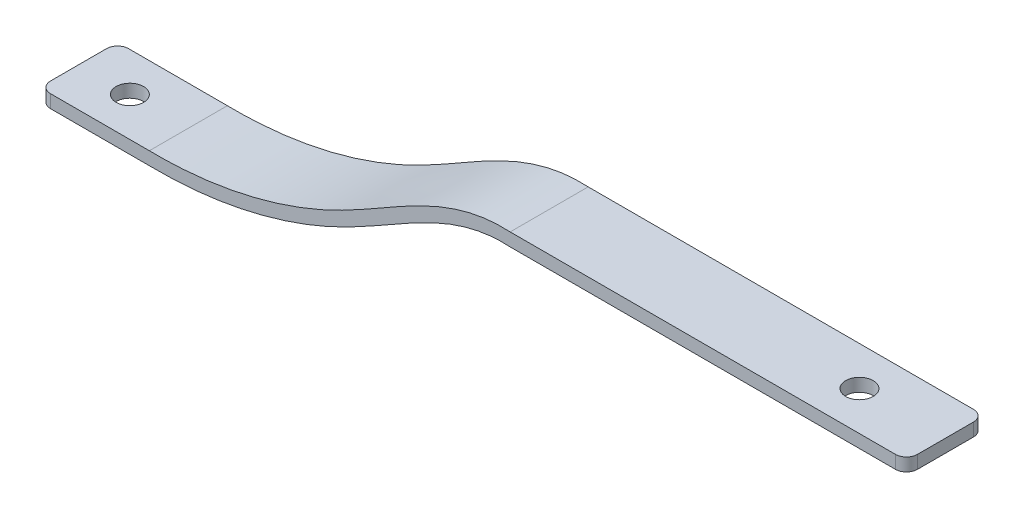
ISO-10303-21;
HEADER;
FILE_DESCRIPTION(('STEP AP214'),'2;1');
FILE_NAME('part.step','',(''),(''),'','','');
FILE_SCHEMA(('AUTOMOTIVE_DESIGN { 1 0 10303 214 1 1 1 1 }'));
ENDSEC;
DATA;
#1=APPLICATION_CONTEXT('core data for automotive mechanical design processes');
#2=APPLICATION_PROTOCOL_DEFINITION('international standard','automotive_design',2000,#1);
#3=PRODUCT_CONTEXT('',#1,'mechanical');
#4=PRODUCT('Part','Part','',(#3));
#5=PRODUCT_RELATED_PRODUCT_CATEGORY('part','',(#4));
#6=PRODUCT_DEFINITION_FORMATION('','',#4);
#7=PRODUCT_DEFINITION_CONTEXT('part definition',#1,'design');
#8=PRODUCT_DEFINITION('design','',#6,#7);
#9=PRODUCT_DEFINITION_SHAPE('','',#8);
#10=(LENGTH_UNIT() NAMED_UNIT(*) SI_UNIT(.MILLI.,.METRE.));
#11=(NAMED_UNIT(*) PLANE_ANGLE_UNIT() SI_UNIT($,.RADIAN.));
#12=(NAMED_UNIT(*) SI_UNIT($,.STERADIAN.) SOLID_ANGLE_UNIT());
#13=UNCERTAINTY_MEASURE_WITH_UNIT(LENGTH_MEASURE(1.E-05),#10,'distance_accuracy_value','');
#14=(GEOMETRIC_REPRESENTATION_CONTEXT(3) GLOBAL_UNCERTAINTY_ASSIGNED_CONTEXT((#13)) GLOBAL_UNIT_ASSIGNED_CONTEXT((#10,
#11,#12)) REPRESENTATION_CONTEXT('',''));
#15=CARTESIAN_POINT('',(0.,0.,0.));
#16=DIRECTION('',(0.,0.,1.));
#17=DIRECTION('',(1.,0.,0.));
#18=AXIS2_PLACEMENT_3D('',#15,#16,#17);
#19=CARTESIAN_POINT('',(0.,-23.9,18.));
#20=DIRECTION('',(1.,0.,0.));
#21=DIRECTION('',(0.,0.,-1.));
#22=AXIS2_PLACEMENT_3D('',#19,#20,#21);
#23=PLANE('',#22);
#24=DIRECTION('',(0.,0.,-1.));
#25=VECTOR('',#24,1.);
#26=CARTESIAN_POINT('',(0.,-26.9,18.));
#27=LINE('',#26,#25);
#28=CARTESIAN_POINT('',(0.,-26.9,15.46));
#29=VERTEX_POINT('',#28);
#30=CARTESIAN_POINT('',(0.,-26.9,2.54));
#31=VERTEX_POINT('',#30);
#32=EDGE_CURVE('E146',#29,#31,#27,.T.);
#33=ORIENTED_EDGE('',*,*,#32,.F.);
#34=DIRECTION('',(0.,-1.,0.));
#35=VECTOR('',#34,1.);
#36=CARTESIAN_POINT('',(0.,-23.9,15.46));
#37=LINE('',#36,#35);
#38=CARTESIAN_POINT('',(0.,-23.9,15.46));
#39=VERTEX_POINT('',#38);
#40=EDGE_CURVE('E225',#29,#39,#37,.F.);
#41=ORIENTED_EDGE('',*,*,#40,.T.);
#42=DIRECTION('',(0.,0.,-1.));
#43=VECTOR('',#42,1.);
#44=CARTESIAN_POINT('',(0.,-23.9,18.));
#45=LINE('',#44,#43);
#46=CARTESIAN_POINT('',(0.,-23.9,2.54));
#47=VERTEX_POINT('',#46);
#48=EDGE_CURVE('E251',#39,#47,#45,.T.);
#49=ORIENTED_EDGE('',*,*,#48,.T.);
#50=DIRECTION('',(0.,-1.,0.));
#51=VECTOR('',#50,1.);
#52=CARTESIAN_POINT('',(0.,-26.9,2.54));
#53=LINE('',#52,#51);
#54=EDGE_CURVE('E222',#47,#31,#53,.T.);
#55=ORIENTED_EDGE('',*,*,#54,.T.);
#56=EDGE_LOOP('',(#33,#41,#49,#55));
#57=FACE_BOUND('',#56,.T.);
#58=ADVANCED_FACE('F37',(#57),#23,.F.);
#59=CARTESIAN_POINT('',(0.,-26.9,18.));
#60=DIRECTION('',(0.,1.,0.));
#61=DIRECTION('',(-1.,0.,0.));
#62=AXIS2_PLACEMENT_3D('',#59,#60,#61);
#63=PLANE('',#62);
#64=CARTESIAN_POINT('',(11.8473744615528,-26.9,9.));
#65=DIRECTION('',(0.,1.,0.));
#66=DIRECTION('',(-1.,0.,0.));
#67=AXIS2_PLACEMENT_3D('',#64,#65,#66);
#68=CIRCLE('',#67,3.175);
#69=CARTESIAN_POINT('',(8.67237446155276,-26.9,9.));
#70=VERTEX_POINT('',#69);
#71=EDGE_CURVE('E310',#70,#70,#68,.T.);
#72=ORIENTED_EDGE('',*,*,#71,.T.);
#73=EDGE_LOOP('',(#72));
#74=FACE_BOUND('',#73,.T.);
#75=DIRECTION('',(1.,0.,0.));
#76=VECTOR('',#75,1.);
#77=CARTESIAN_POINT('',(0.,-26.9,18.));
#78=LINE('',#77,#76);
#79=CARTESIAN_POINT('',(2.54,-26.9,18.));
#80=VERTEX_POINT('',#79);
#81=CARTESIAN_POINT('',(25.3146595438533,-26.9,18.));
#82=VERTEX_POINT('',#81);
#83=EDGE_CURVE('E126',#80,#82,#78,.T.);
#84=ORIENTED_EDGE('',*,*,#83,.F.);
#85=CARTESIAN_POINT('',(2.54,-26.9,15.46));
#86=DIRECTION('',(0.,1.,0.));
#87=DIRECTION('',(-1.,0.,0.));
#88=AXIS2_PLACEMENT_3D('',#85,#86,#87);
#89=CIRCLE('',#88,2.54);
#90=EDGE_CURVE('E220',#80,#29,#89,.F.);
#91=ORIENTED_EDGE('',*,*,#90,.T.);
#92=ORIENTED_EDGE('',*,*,#32,.T.);
#93=CARTESIAN_POINT('',(2.54,-26.9,2.54));
#94=DIRECTION('',(0.,1.,0.));
#95=DIRECTION('',(-1.,0.,0.));
#96=AXIS2_PLACEMENT_3D('',#93,#94,#95);
#97=CIRCLE('',#96,2.54);
#98=CARTESIAN_POINT('',(2.54,-26.9,0.));
#99=VERTEX_POINT('',#98);
#100=EDGE_CURVE('E212',#31,#99,#97,.F.);
#101=ORIENTED_EDGE('',*,*,#100,.T.);
#102=DIRECTION('',(1.,0.,0.));
#103=VECTOR('',#102,1.);
#104=CARTESIAN_POINT('',(0.,-26.9,0.));
#105=LINE('',#104,#103);
#106=CARTESIAN_POINT('',(25.3146595438533,-26.9,0.));
#107=VERTEX_POINT('',#106);
#108=EDGE_CURVE('E143',#99,#107,#105,.T.);
#109=ORIENTED_EDGE('',*,*,#108,.T.);
#110=DIRECTION('',(0.,0.,-1.));
#111=VECTOR('',#110,1.);
#112=CARTESIAN_POINT('',(25.3146595438533,-26.9,18.));
#113=LINE('',#112,#111);
#114=EDGE_CURVE('E140',#82,#107,#113,.T.);
#115=ORIENTED_EDGE('',*,*,#114,.F.);
#116=EDGE_LOOP('',(#84,#91,#92,#101,#109,#115));
#117=FACE_BOUND('',#116,.T.);
#118=ADVANCED_FACE('F141',(#74,#117),#63,.F.);
#119=CARTESIAN_POINT('',(25.3146595438533,-26.9,18.));
#120=CARTESIAN_POINT('',(29.0188089023951,-26.9594659895073,18.));
#121=CARTESIAN_POINT('',(36.4383206519169,-26.6538189362123,18.));
#122=CARTESIAN_POINT('',(47.4522737321045,-24.9248831297301,18.));
#123=CARTESIAN_POINT('',(58.2624866138257,-21.9243187824402,18.));
#124=CARTESIAN_POINT('',(67.0160136019704,-18.3796569401195,18.));
#125=CARTESIAN_POINT('',(73.8117428512232,-14.8903088175918,18.));
#126=CARTESIAN_POINT('',(80.4274132065217,-11.1303025465361,18.));
#127=CARTESIAN_POINT('',(86.8972359139718,-7.36910982344604,18.));
#128=CARTESIAN_POINT('',(93.386399422182,-4.32704164879955,18.));
#129=CARTESIAN_POINT('',(98.2984726060715,-2.5786662778352,18.));
#130=CARTESIAN_POINT('',(102.470883409743,-1.70349458257518,18.));
#131=CARTESIAN_POINT('',(105.870866673329,-1.42833186149195,18.));
#132=CARTESIAN_POINT('',(107.62357722685,-1.44998458261965,18.));
#133=CARTESIAN_POINT('',(108.491279544418,-1.5,18.));
#134=B_SPLINE_CURVE_WITH_KNOTS('',3,(#119,#120,#121,#122,#123,#124,#125,#126,#127,#128,#129,
#130,#131,#132,#133),.UNSPECIFIED.,.F.,.F.,(4,1,1,1,1,1,1,1,1,1,1,1,4),(0.000136912202319817,
0.125180550793314,0.250224189384307,0.375267827975301,0.500311466566295,0.562833285861792,
0.625355105157289,0.750398743748282,0.812920563043779,0.875442382339276,0.937964201634773,
0.969225111282522,1.00048602093027),.UNSPECIFIED.);
#135=DIRECTION('',(0.,0.,-1.));
#136=VECTOR('',#135,1.);
#137=SURFACE_OF_LINEAR_EXTRUSION('',#134,#136);
#138=CARTESIAN_POINT('',(25.3146595438533,-26.9,0.));
#139=CARTESIAN_POINT('',(29.0188089023951,-26.9594659895073,0.));
#140=CARTESIAN_POINT('',(36.4383206519169,-26.6538189362123,0.));
#141=CARTESIAN_POINT('',(47.4522737321045,-24.9248831297301,0.));
#142=CARTESIAN_POINT('',(58.2624866138257,-21.9243187824402,0.));
#143=CARTESIAN_POINT('',(67.0160136019704,-18.3796569401195,0.));
#144=CARTESIAN_POINT('',(73.8117428512232,-14.8903088175918,0.));
#145=CARTESIAN_POINT('',(80.4274132065217,-11.1303025465361,0.));
#146=CARTESIAN_POINT('',(86.8972359139718,-7.36910982344604,0.));
#147=CARTESIAN_POINT('',(93.386399422182,-4.32704164879955,0.));
#148=CARTESIAN_POINT('',(98.2984726060715,-2.5786662778352,0.));
#149=CARTESIAN_POINT('',(102.470883409743,-1.70349458257518,0.));
#150=CARTESIAN_POINT('',(105.870866673329,-1.42833186149195,0.));
#151=CARTESIAN_POINT('',(107.62357722685,-1.44998458261965,0.));
#152=CARTESIAN_POINT('',(108.491279544418,-1.5,0.));
#153=B_SPLINE_CURVE_WITH_KNOTS('',3,(#138,#139,#140,#141,#142,#143,#144,#145,#146,#147,#148,
#149,#150,#151,#152),.UNSPECIFIED.,.F.,.F.,(4,1,1,1,1,1,1,1,1,1,1,1,4),(0.000136912202319817,
0.125180550793314,0.250224189384307,0.375267827975301,0.500311466566295,0.562833285861792,
0.625355105157289,0.750398743748282,0.812920563043779,0.875442382339276,0.937964201634773,
0.969225111282522,1.00048602093027),.UNSPECIFIED.);
#154=CARTESIAN_POINT('',(108.491279544418,-1.5,0.));
#155=VERTEX_POINT('',#154);
#156=EDGE_CURVE('E268',#107,#155,#153,.T.);
#157=ORIENTED_EDGE('',*,*,#156,.T.);
#158=DIRECTION('',(0.,0.,-1.));
#159=VECTOR('',#158,1.);
#160=CARTESIAN_POINT('',(108.491279544418,-1.5,18.));
#161=LINE('',#160,#159);
#162=CARTESIAN_POINT('',(108.491279544418,-1.5,18.));
#163=VERTEX_POINT('',#162);
#164=EDGE_CURVE('E147',#163,#155,#161,.T.);
#165=ORIENTED_EDGE('',*,*,#164,.F.);
#166=EDGE_CURVE('E132',#82,#163,#134,.T.);
#167=ORIENTED_EDGE('',*,*,#166,.F.);
#168=ORIENTED_EDGE('',*,*,#114,.T.);
#169=EDGE_LOOP('',(#157,#165,#167,#168));
#170=FACE_BOUND('',#169,.T.);
#171=ADVANCED_FACE('F149',(#170),#137,.F.);
#172=CARTESIAN_POINT('',(108.491279544418,-1.5,18.));
#173=DIRECTION('',(0.,1.,0.));
#174=DIRECTION('',(-1.,0.,0.));
#175=AXIS2_PLACEMENT_3D('',#172,#173,#174);
#176=PLANE('',#175);
#177=CARTESIAN_POINT('',(180.157387408216,-1.5,9.));
#178=DIRECTION('',(0.,1.,0.));
#179=DIRECTION('',(-1.,0.,0.));
#180=AXIS2_PLACEMENT_3D('',#177,#178,#179);
#181=CIRCLE('',#180,3.175);
#182=CARTESIAN_POINT('',(176.982387408216,-1.5,9.));
#183=VERTEX_POINT('',#182);
#184=EDGE_CURVE('E308',#183,#183,#181,.T.);
#185=ORIENTED_EDGE('',*,*,#184,.T.);
#186=EDGE_LOOP('',(#185));
#187=FACE_BOUND('',#186,.T.);
#188=DIRECTION('',(1.,0.,0.));
#189=VECTOR('',#188,1.);
#190=CARTESIAN_POINT('',(108.491279544418,-1.5,0.));
#191=LINE('',#190,#189);
#192=CARTESIAN_POINT('',(197.46,-1.5,0.));
#193=VERTEX_POINT('',#192);
#194=EDGE_CURVE('E267',#155,#193,#191,.T.);
#195=ORIENTED_EDGE('',*,*,#194,.T.);
#196=CARTESIAN_POINT('',(197.46,-1.5,2.54));
#197=DIRECTION('',(0.,1.,0.));
#198=DIRECTION('',(-1.,0.,0.));
#199=AXIS2_PLACEMENT_3D('',#196,#197,#198);
#200=CIRCLE('',#199,2.54);
#201=CARTESIAN_POINT('',(200.,-1.5,2.54));
#202=VERTEX_POINT('',#201);
#203=EDGE_CURVE('E11',#193,#202,#200,.F.);
#204=ORIENTED_EDGE('',*,*,#203,.T.);
#205=DIRECTION('',(0.,0.,-1.));
#206=VECTOR('',#205,1.);
#207=CARTESIAN_POINT('',(200.,-1.5,18.));
#208=LINE('',#207,#206);
#209=CARTESIAN_POINT('',(200.,-1.5,15.46));
#210=VERTEX_POINT('',#209);
#211=EDGE_CURVE('E206',#210,#202,#208,.T.);
#212=ORIENTED_EDGE('',*,*,#211,.F.);
#213=CARTESIAN_POINT('',(197.46,-1.5,15.46));
#214=DIRECTION('',(0.,1.,0.));
#215=DIRECTION('',(-1.,0.,0.));
#216=AXIS2_PLACEMENT_3D('',#213,#214,#215);
#217=CIRCLE('',#216,2.54);
#218=CARTESIAN_POINT('',(197.46,-1.5,18.));
#219=VERTEX_POINT('',#218);
#220=EDGE_CURVE('E45',#210,#219,#217,.F.);
#221=ORIENTED_EDGE('',*,*,#220,.T.);
#222=DIRECTION('',(1.,0.,0.));
#223=VECTOR('',#222,1.);
#224=CARTESIAN_POINT('',(108.491279544418,-1.5,18.));
#225=LINE('',#224,#223);
#226=EDGE_CURVE('E152',#163,#219,#225,.T.);
#227=ORIENTED_EDGE('',*,*,#226,.F.);
#228=ORIENTED_EDGE('',*,*,#164,.T.);
#229=EDGE_LOOP('',(#195,#204,#212,#221,#227,#228));
#230=FACE_BOUND('',#229,.T.);
#231=ADVANCED_FACE('F168',(#187,#230),#176,.F.);
#232=CARTESIAN_POINT('',(200.,1.5,18.));
#233=DIRECTION('',(-1.,0.,0.));
#234=DIRECTION('',(0.,0.,1.));
#235=AXIS2_PLACEMENT_3D('',#232,#233,#234);
#236=PLANE('',#235);
#237=ORIENTED_EDGE('',*,*,#211,.T.);
#238=DIRECTION('',(0.,1.,0.));
#239=VECTOR('',#238,1.);
#240=CARTESIAN_POINT('',(200.,1.5,2.54));
#241=LINE('',#240,#239);
#242=CARTESIAN_POINT('',(200.,1.5,2.54));
#243=VERTEX_POINT('',#242);
#244=EDGE_CURVE('E195',#202,#243,#241,.T.);
#245=ORIENTED_EDGE('',*,*,#244,.T.);
#246=DIRECTION('',(0.,0.,-1.));
#247=VECTOR('',#246,1.);
#248=CARTESIAN_POINT('',(200.,1.5,18.));
#249=LINE('',#248,#247);
#250=CARTESIAN_POINT('',(200.,1.5,15.46));
#251=VERTEX_POINT('',#250);
#252=EDGE_CURVE('E263',#251,#243,#249,.T.);
#253=ORIENTED_EDGE('',*,*,#252,.F.);
#254=DIRECTION('',(0.,1.,0.));
#255=VECTOR('',#254,1.);
#256=CARTESIAN_POINT('',(200.,1.5,15.46));
#257=LINE('',#256,#255);
#258=EDGE_CURVE('E57',#251,#210,#257,.F.);
#259=ORIENTED_EDGE('',*,*,#258,.T.);
#260=EDGE_LOOP('',(#237,#245,#253,#259));
#261=FACE_BOUND('',#260,.T.);
#262=ADVANCED_FACE('F288',(#261),#236,.F.);
#263=CARTESIAN_POINT('',(108.577128093898,1.49999999999999,18.));
#264=DIRECTION('',(0.,-1.,0.));
#265=DIRECTION('',(1.,0.,0.));
#266=AXIS2_PLACEMENT_3D('',#263,#264,#265);
#267=PLANE('',#266);
#268=CARTESIAN_POINT('',(180.157387408216,1.49999999999999,9.));
#269=DIRECTION('',(0.,1.,0.));
#270=DIRECTION('',(-1.,0.,0.));
#271=AXIS2_PLACEMENT_3D('',#268,#269,#270);
#272=CIRCLE('',#271,3.175);
#273=CARTESIAN_POINT('',(176.982387408216,1.49999999999999,9.));
#274=VERTEX_POINT('',#273);
#275=EDGE_CURVE('E315',#274,#274,#272,.T.);
#276=ORIENTED_EDGE('',*,*,#275,.F.);
#277=EDGE_LOOP('',(#276));
#278=FACE_BOUND('',#277,.T.);
#279=ORIENTED_EDGE('',*,*,#252,.T.);
#280=CARTESIAN_POINT('',(197.46,1.5,2.54));
#281=DIRECTION('',(0.,-1.,0.));
#282=DIRECTION('',(1.,0.,0.));
#283=AXIS2_PLACEMENT_3D('',#280,#281,#282);
#284=CIRCLE('',#283,2.54);
#285=CARTESIAN_POINT('',(197.46,1.5,0.));
#286=VERTEX_POINT('',#285);
#287=EDGE_CURVE('E196',#243,#286,#284,.F.);
#288=ORIENTED_EDGE('',*,*,#287,.T.);
#289=DIRECTION('',(-1.,0.,0.));
#290=VECTOR('',#289,1.);
#291=CARTESIAN_POINT('',(108.577128093898,1.49999999999999,0.));
#292=LINE('',#291,#290);
#293=CARTESIAN_POINT('',(108.577128093898,1.49999999999999,0.));
#294=VERTEX_POINT('',#293);
#295=EDGE_CURVE('E270',#286,#294,#292,.T.);
#296=ORIENTED_EDGE('',*,*,#295,.T.);
#297=DIRECTION('',(0.,0.,-1.));
#298=VECTOR('',#297,1.);
#299=CARTESIAN_POINT('',(108.577128093898,1.49999999999999,18.));
#300=LINE('',#299,#298);
#301=CARTESIAN_POINT('',(108.577128093898,1.49999999999999,18.));
#302=VERTEX_POINT('',#301);
#303=EDGE_CURVE('E255',#302,#294,#300,.T.);
#304=ORIENTED_EDGE('',*,*,#303,.F.);
#305=DIRECTION('',(-1.,0.,0.));
#306=VECTOR('',#305,1.);
#307=CARTESIAN_POINT('',(108.577128093898,1.49999999999999,18.));
#308=LINE('',#307,#306);
#309=CARTESIAN_POINT('',(197.46,1.5,18.));
#310=VERTEX_POINT('',#309);
#311=EDGE_CURVE('E154',#310,#302,#308,.T.);
#312=ORIENTED_EDGE('',*,*,#311,.F.);
#313=CARTESIAN_POINT('',(197.46,1.5,15.46));
#314=DIRECTION('',(0.,-1.,0.));
#315=DIRECTION('',(1.,0.,0.));
#316=AXIS2_PLACEMENT_3D('',#313,#314,#315);
#317=CIRCLE('',#316,2.54);
#318=EDGE_CURVE('E198',#310,#251,#317,.F.);
#319=ORIENTED_EDGE('',*,*,#318,.T.);
#320=EDGE_LOOP('',(#279,#288,#296,#304,#312,#319));
#321=FACE_BOUND('',#320,.T.);
#322=ADVANCED_FACE('F287',(#278,#321),#267,.F.);
#323=CARTESIAN_POINT('',(108.577128093898,1.49999999999999,18.));
#324=CARTESIAN_POINT('',(107.618230329989,1.55390102329499,18.));
#325=CARTESIAN_POINT('',(105.679869219331,1.57019239529077,18.));
#326=CARTESIAN_POINT('',(101.932358433972,1.25768993450628,18.));
#327=CARTESIAN_POINT('',(97.3881306078473,0.29011244531542,18.));
#328=CARTESIAN_POINT('',(92.1558948845653,-1.5851373976083,18.));
#329=CARTESIAN_POINT('',(85.3949770849972,-4.7667373788956,18.));
#330=CARTESIAN_POINT('',(78.8488467239236,-8.57909358736543,18.));
#331=CARTESIAN_POINT('',(72.3147602776489,-12.2884855401058,18.));
#332=CARTESIAN_POINT('',(65.7324938138277,-15.6624775430745,18.));
#333=CARTESIAN_POINT('',(57.2484472089135,-19.0934108720935,18.));
#334=CARTESIAN_POINT('',(46.7783237633653,-21.9940665798706,18.));
#335=CARTESIAN_POINT('',(36.111765906608,-23.66482794599,18.));
#336=CARTESIAN_POINT('',(28.9261620883657,-23.9580396061826,18.));
#337=CARTESIAN_POINT('',(25.3388796665266,-23.9,18.));
#338=B_SPLINE_CURVE_WITH_KNOTS('',3,(#323,#324,#325,#326,#327,#328,#329,#330,#331,#332,#333,
#334,#335,#336,#337),.UNSPECIFIED.,.F.,.F.,(4,1,1,1,1,1,1,1,1,1,1,1,4),(-0.000138519880971891,
0.03110117925142,0.0623408783838119,0.124820276648596,0.187299674913379,0.249779073178163,
0.37473786970773,0.437217267972514,0.499696666237298,0.624655462766865,0.749614259296433,
0.874573055826,0.999531852355567),.UNSPECIFIED.);
#339=DIRECTION('',(0.,0.,-1.));
#340=VECTOR('',#339,1.);
#341=SURFACE_OF_LINEAR_EXTRUSION('',#338,#340);
#342=CARTESIAN_POINT('',(108.577128093898,1.49999999999999,0.));
#343=CARTESIAN_POINT('',(107.618230329989,1.55390102329499,0.));
#344=CARTESIAN_POINT('',(105.679869219331,1.57019239529077,0.));
#345=CARTESIAN_POINT('',(101.932358433972,1.25768993450628,0.));
#346=CARTESIAN_POINT('',(97.3881306078473,0.29011244531542,0.));
#347=CARTESIAN_POINT('',(92.1558948845653,-1.5851373976083,0.));
#348=CARTESIAN_POINT('',(85.3949770849972,-4.7667373788956,0.));
#349=CARTESIAN_POINT('',(78.8488467239236,-8.57909358736543,0.));
#350=CARTESIAN_POINT('',(72.3147602776489,-12.2884855401058,0.));
#351=CARTESIAN_POINT('',(65.7324938138277,-15.6624775430745,0.));
#352=CARTESIAN_POINT('',(57.2484472089135,-19.0934108720935,0.));
#353=CARTESIAN_POINT('',(46.7783237633653,-21.9940665798706,0.));
#354=CARTESIAN_POINT('',(36.111765906608,-23.66482794599,0.));
#355=CARTESIAN_POINT('',(28.9261620883657,-23.9580396061826,0.));
#356=CARTESIAN_POINT('',(25.3388796665266,-23.9,0.));
#357=B_SPLINE_CURVE_WITH_KNOTS('',3,(#342,#343,#344,#345,#346,#347,#348,#349,#350,#351,#352,
#353,#354,#355,#356),.UNSPECIFIED.,.F.,.F.,(4,1,1,1,1,1,1,1,1,1,1,1,4),(-0.000138519880971891,
0.03110117925142,0.0623408783838119,0.124820276648596,0.187299674913379,0.249779073178163,
0.37473786970773,0.437217267972514,0.499696666237298,0.624655462766865,0.749614259296433,
0.874573055826,0.999531852355567),.UNSPECIFIED.);
#358=CARTESIAN_POINT('',(25.3388796665266,-23.9,0.));
#359=VERTEX_POINT('',#358);
#360=EDGE_CURVE('E246',#294,#359,#357,.T.);
#361=ORIENTED_EDGE('',*,*,#360,.T.);
#362=DIRECTION('',(0.,0.,-1.));
#363=VECTOR('',#362,1.);
#364=CARTESIAN_POINT('',(25.3388796665266,-23.9,18.));
#365=LINE('',#364,#363);
#366=CARTESIAN_POINT('',(25.3388796665266,-23.9,18.));
#367=VERTEX_POINT('',#366);
#368=EDGE_CURVE('E245',#367,#359,#365,.T.);
#369=ORIENTED_EDGE('',*,*,#368,.F.);
#370=EDGE_CURVE('E257',#302,#367,#338,.T.);
#371=ORIENTED_EDGE('',*,*,#370,.F.);
#372=ORIENTED_EDGE('',*,*,#303,.T.);
#373=EDGE_LOOP('',(#361,#369,#371,#372));
#374=FACE_BOUND('',#373,.T.);
#375=ADVANCED_FACE('F283',(#374),#341,.F.);
#376=CARTESIAN_POINT('',(0.,-23.9,18.));
#377=DIRECTION('',(0.,-1.,0.));
#378=DIRECTION('',(1.,0.,0.));
#379=AXIS2_PLACEMENT_3D('',#376,#377,#378);
#380=PLANE('',#379);
#381=CARTESIAN_POINT('',(11.8473744615528,-23.9,9.));
#382=DIRECTION('',(0.,-1.,0.));
#383=DIRECTION('',(1.,0.,0.));
#384=AXIS2_PLACEMENT_3D('',#381,#382,#383);
#385=CIRCLE('',#384,3.175);
#386=CARTESIAN_POINT('',(15.0223744615528,-23.9,9.));
#387=VERTEX_POINT('',#386);
#388=EDGE_CURVE('E217',#387,#387,#385,.T.);
#389=ORIENTED_EDGE('',*,*,#388,.T.);
#390=EDGE_LOOP('',(#389));
#391=FACE_BOUND('',#390,.T.);
#392=ORIENTED_EDGE('',*,*,#48,.F.);
#393=CARTESIAN_POINT('',(2.54,-23.9,15.46));
#394=DIRECTION('',(0.,-1.,0.));
#395=DIRECTION('',(1.,0.,0.));
#396=AXIS2_PLACEMENT_3D('',#393,#394,#395);
#397=CIRCLE('',#396,2.54);
#398=CARTESIAN_POINT('',(2.54,-23.9,18.));
#399=VERTEX_POINT('',#398);
#400=EDGE_CURVE('E229',#39,#399,#397,.F.);
#401=ORIENTED_EDGE('',*,*,#400,.T.);
#402=DIRECTION('',(-1.,0.,0.));
#403=VECTOR('',#402,1.);
#404=CARTESIAN_POINT('',(0.,-23.9,18.));
#405=LINE('',#404,#403);
#406=EDGE_CURVE('E253',#367,#399,#405,.T.);
#407=ORIENTED_EDGE('',*,*,#406,.F.);
#408=ORIENTED_EDGE('',*,*,#368,.T.);
#409=DIRECTION('',(-1.,0.,0.));
#410=VECTOR('',#409,1.);
#411=CARTESIAN_POINT('',(0.,-23.9,0.));
#412=LINE('',#411,#410);
#413=CARTESIAN_POINT('',(2.54,-23.9,0.));
#414=VERTEX_POINT('',#413);
#415=EDGE_CURVE('E137',#359,#414,#412,.T.);
#416=ORIENTED_EDGE('',*,*,#415,.T.);
#417=CARTESIAN_POINT('',(2.54,-23.9,2.54));
#418=DIRECTION('',(0.,-1.,0.));
#419=DIRECTION('',(1.,0.,0.));
#420=AXIS2_PLACEMENT_3D('',#417,#418,#419);
#421=CIRCLE('',#420,2.54);
#422=EDGE_CURVE('E227',#414,#47,#421,.F.);
#423=ORIENTED_EDGE('',*,*,#422,.T.);
#424=EDGE_LOOP('',(#392,#401,#407,#408,#416,#423));
#425=FACE_BOUND('',#424,.T.);
#426=ADVANCED_FACE('F241',(#391,#425),#380,.F.);
#427=CARTESIAN_POINT('',(68.6976882191784,-17.452851688765,18.));
#428=DIRECTION('',(0.,0.,-1.));
#429=DIRECTION('',(-1.,0.,0.));
#430=AXIS2_PLACEMENT_3D('',#427,#428,#429);
#431=PLANE('',#430);
#432=ORIENTED_EDGE('',*,*,#406,.T.);
#433=DIRECTION('',(0.,-1.,0.));
#434=VECTOR('',#433,1.);
#435=CARTESIAN_POINT('',(2.54,-17.452851688765,18.));
#436=LINE('',#435,#434);
#437=EDGE_CURVE('E135',#399,#80,#436,.T.);
#438=ORIENTED_EDGE('',*,*,#437,.T.);
#439=ORIENTED_EDGE('',*,*,#83,.T.);
#440=ORIENTED_EDGE('',*,*,#166,.T.);
#441=ORIENTED_EDGE('',*,*,#226,.T.);
#442=DIRECTION('',(0.,1.,0.));
#443=VECTOR('',#442,1.);
#444=CARTESIAN_POINT('',(197.46,-17.452851688765,18.));
#445=LINE('',#444,#443);
#446=EDGE_CURVE('E209',#219,#310,#445,.T.);
#447=ORIENTED_EDGE('',*,*,#446,.T.);
#448=ORIENTED_EDGE('',*,*,#311,.T.);
#449=ORIENTED_EDGE('',*,*,#370,.T.);
#450=EDGE_LOOP('',(#432,#438,#439,#440,#441,#447,#448,#449));
#451=FACE_BOUND('',#450,.T.);
#452=ADVANCED_FACE('F129',(#451),#431,.F.);
#453=CARTESIAN_POINT('',(68.6976882191784,-17.452851688765,0.));
#454=DIRECTION('',(0.,0.,-1.));
#455=DIRECTION('',(-1.,0.,0.));
#456=AXIS2_PLACEMENT_3D('',#453,#454,#455);
#457=PLANE('',#456);
#458=ORIENTED_EDGE('',*,*,#108,.F.);
#459=DIRECTION('',(0.,-1.,0.));
#460=VECTOR('',#459,1.);
#461=CARTESIAN_POINT('',(2.54,-23.9,0.));
#462=LINE('',#461,#460);
#463=EDGE_CURVE('E201',#99,#414,#462,.F.);
#464=ORIENTED_EDGE('',*,*,#463,.T.);
#465=ORIENTED_EDGE('',*,*,#415,.F.);
#466=ORIENTED_EDGE('',*,*,#360,.F.);
#467=ORIENTED_EDGE('',*,*,#295,.F.);
#468=DIRECTION('',(0.,1.,0.));
#469=VECTOR('',#468,1.);
#470=CARTESIAN_POINT('',(197.46,-1.5,0.));
#471=LINE('',#470,#469);
#472=EDGE_CURVE('E193',#286,#193,#471,.F.);
#473=ORIENTED_EDGE('',*,*,#472,.T.);
#474=ORIENTED_EDGE('',*,*,#194,.F.);
#475=ORIENTED_EDGE('',*,*,#156,.F.);
#476=EDGE_LOOP('',(#458,#464,#465,#466,#467,#473,#474,#475));
#477=FACE_BOUND('',#476,.T.);
#478=ADVANCED_FACE('F235',(#477),#457,.T.);
#479=CARTESIAN_POINT('',(11.8473744615528,-26.9594659895073,9.));
#480=DIRECTION('',(0.,1.,0.));
#481=DIRECTION('',(-1.,0.,0.));
#482=AXIS2_PLACEMENT_3D('',#479,#480,#481);
#483=CYLINDRICAL_SURFACE('',#482,3.175);
#484=ORIENTED_EDGE('',*,*,#388,.F.);
#485=EDGE_LOOP('',(#484));
#486=FACE_BOUND('',#485,.T.);
#487=ORIENTED_EDGE('',*,*,#71,.F.);
#488=EDGE_LOOP('',(#487));
#489=FACE_BOUND('',#488,.T.);
#490=ADVANCED_FACE('F323',(#486,#489),#483,.F.);
#491=CARTESIAN_POINT('',(180.157387408216,-26.9594659895073,9.));
#492=DIRECTION('',(0.,1.,0.));
#493=DIRECTION('',(-1.,0.,0.));
#494=AXIS2_PLACEMENT_3D('',#491,#492,#493);
#495=CYLINDRICAL_SURFACE('',#494,3.175);
#496=ORIENTED_EDGE('',*,*,#275,.T.);
#497=EDGE_LOOP('',(#496));
#498=FACE_BOUND('',#497,.T.);
#499=ORIENTED_EDGE('',*,*,#184,.F.);
#500=EDGE_LOOP('',(#499));
#501=FACE_BOUND('',#500,.T.);
#502=ADVANCED_FACE('F180',(#498,#501),#495,.F.);
#503=CARTESIAN_POINT('',(2.54,-17.452851688765,15.46));
#504=DIRECTION('',(0.,-1.,0.));
#505=DIRECTION('',(0.,0.,-1.));
#506=AXIS2_PLACEMENT_3D('',#503,#504,#505);
#507=CYLINDRICAL_SURFACE('',#506,2.54);
#508=ORIENTED_EDGE('',*,*,#400,.F.);
#509=ORIENTED_EDGE('',*,*,#40,.F.);
#510=ORIENTED_EDGE('',*,*,#90,.F.);
#511=ORIENTED_EDGE('',*,*,#437,.F.);
#512=EDGE_LOOP('',(#508,#509,#510,#511));
#513=FACE_BOUND('',#512,.T.);
#514=ADVANCED_FACE('F176',(#513),#507,.T.);
#515=CARTESIAN_POINT('',(2.54,-23.9,2.54));
#516=DIRECTION('',(0.,1.,0.));
#517=DIRECTION('',(0.,0.,1.));
#518=AXIS2_PLACEMENT_3D('',#515,#516,#517);
#519=CYLINDRICAL_SURFACE('',#518,2.54);
#520=ORIENTED_EDGE('',*,*,#422,.F.);
#521=ORIENTED_EDGE('',*,*,#463,.F.);
#522=ORIENTED_EDGE('',*,*,#100,.F.);
#523=ORIENTED_EDGE('',*,*,#54,.F.);
#524=EDGE_LOOP('',(#520,#521,#522,#523));
#525=FACE_BOUND('',#524,.T.);
#526=ADVANCED_FACE('F179',(#525),#519,.T.);
#527=CARTESIAN_POINT('',(197.46,1.5,2.54));
#528=DIRECTION('',(0.,-1.,0.));
#529=DIRECTION('',(0.,0.,-1.));
#530=AXIS2_PLACEMENT_3D('',#527,#528,#529);
#531=CYLINDRICAL_SURFACE('',#530,2.54);
#532=ORIENTED_EDGE('',*,*,#203,.F.);
#533=ORIENTED_EDGE('',*,*,#472,.F.);
#534=ORIENTED_EDGE('',*,*,#287,.F.);
#535=ORIENTED_EDGE('',*,*,#244,.F.);
#536=EDGE_LOOP('',(#532,#533,#534,#535));
#537=FACE_BOUND('',#536,.T.);
#538=ADVANCED_FACE('F183',(#537),#531,.T.);
#539=CARTESIAN_POINT('',(197.46,-17.452851688765,15.46));
#540=DIRECTION('',(0.,1.,0.));
#541=DIRECTION('',(0.,0.,1.));
#542=AXIS2_PLACEMENT_3D('',#539,#540,#541);
#543=CYLINDRICAL_SURFACE('',#542,2.54);
#544=ORIENTED_EDGE('',*,*,#220,.F.);
#545=ORIENTED_EDGE('',*,*,#258,.F.);
#546=ORIENTED_EDGE('',*,*,#318,.F.);
#547=ORIENTED_EDGE('',*,*,#446,.F.);
#548=EDGE_LOOP('',(#544,#545,#546,#547));
#549=FACE_BOUND('',#548,.T.);
#550=ADVANCED_FACE('F39',(#549),#543,.T.);
#551=CLOSED_SHELL('',(#58,#118,#171,#231,#262,#322,#375,#426,#452,#478,#490,#502,#514,#526,#538,#550));
#552=MANIFOLD_SOLID_BREP('B2',#551);
#553=ADVANCED_BREP_SHAPE_REPRESENTATION('',(#18,#552),#14);
#554=SHAPE_DEFINITION_REPRESENTATION(#9,#553);
ENDSEC;
END-ISO-10303-21;
